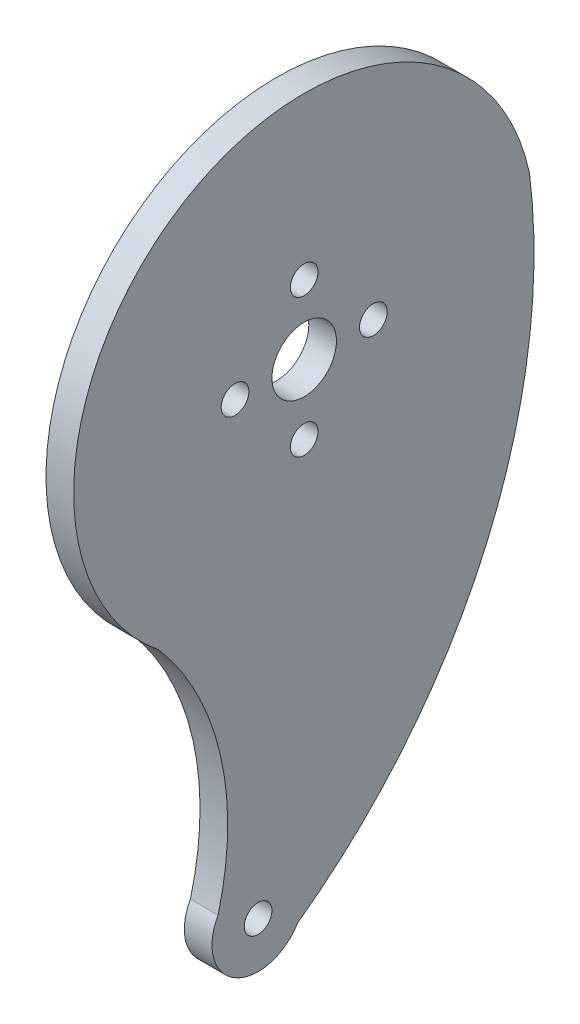
ISO-10303-21;
HEADER;
FILE_DESCRIPTION(('STEP AP214'),'2;1');
FILE_NAME('part.step','',(''),(''),'','','');
FILE_SCHEMA(('AUTOMOTIVE_DESIGN { 1 0 10303 214 1 1 1 1 }'));
ENDSEC;
DATA;
#1=APPLICATION_CONTEXT('core data for automotive mechanical design processes');
#2=APPLICATION_PROTOCOL_DEFINITION('international standard','automotive_design',2000,#1);
#3=PRODUCT_CONTEXT('',#1,'mechanical');
#4=PRODUCT('Part','Part','',(#3));
#5=PRODUCT_RELATED_PRODUCT_CATEGORY('part','',(#4));
#6=PRODUCT_DEFINITION_FORMATION('','',#4);
#7=PRODUCT_DEFINITION_CONTEXT('part definition',#1,'design');
#8=PRODUCT_DEFINITION('design','',#6,#7);
#9=PRODUCT_DEFINITION_SHAPE('','',#8);
#10=(LENGTH_UNIT() NAMED_UNIT(*) SI_UNIT(.MILLI.,.METRE.));
#11=(NAMED_UNIT(*) PLANE_ANGLE_UNIT() SI_UNIT($,.RADIAN.));
#12=(NAMED_UNIT(*) SI_UNIT($,.STERADIAN.) SOLID_ANGLE_UNIT());
#13=UNCERTAINTY_MEASURE_WITH_UNIT(LENGTH_MEASURE(1.E-05),#10,'distance_accuracy_value','');
#14=(GEOMETRIC_REPRESENTATION_CONTEXT(3) GLOBAL_UNCERTAINTY_ASSIGNED_CONTEXT((#13)) GLOBAL_UNIT_ASSIGNED_CONTEXT((#10,
#11,#12)) REPRESENTATION_CONTEXT('',''));
#15=CARTESIAN_POINT('',(0.,0.,0.));
#16=DIRECTION('',(0.,0.,1.));
#17=DIRECTION('',(1.,0.,0.));
#18=AXIS2_PLACEMENT_3D('',#15,#16,#17);
#19=CARTESIAN_POINT('',(3.,-19.7769228284302,19.6157243721853));
#20=DIRECTION('',(1.,0.,0.));
#21=DIRECTION('',(0.,0.,-1.));
#22=AXIS2_PLACEMENT_3D('',#19,#20,#21);
#23=PLANE('',#22);
#24=CARTESIAN_POINT('',(3.,0.,-7.5));
#25=DIRECTION('',(1.,0.,0.));
#26=DIRECTION('',(0.,0.,-1.));
#27=AXIS2_PLACEMENT_3D('',#24,#25,#26);
#28=CIRCLE('',#27,1.5);
#29=CARTESIAN_POINT('',(3.,0.,-9.));
#30=VERTEX_POINT('',#29);
#31=EDGE_CURVE('E132',#30,#30,#28,.T.);
#32=ORIENTED_EDGE('',*,*,#31,.F.);
#33=EDGE_LOOP('',(#32));
#34=FACE_BOUND('',#33,.T.);
#35=CARTESIAN_POINT('',(3.,0.,7.5));
#36=DIRECTION('',(1.,0.,0.));
#37=DIRECTION('',(0.,0.,-1.));
#38=AXIS2_PLACEMENT_3D('',#35,#36,#37);
#39=CIRCLE('',#38,1.5);
#40=CARTESIAN_POINT('',(3.,0.,6.));
#41=VERTEX_POINT('',#40);
#42=EDGE_CURVE('E120',#41,#41,#39,.T.);
#43=ORIENTED_EDGE('',*,*,#42,.F.);
#44=EDGE_LOOP('',(#43));
#45=FACE_BOUND('',#44,.T.);
#46=CARTESIAN_POINT('',(3.,0.,0.));
#47=DIRECTION('',(1.,0.,0.));
#48=DIRECTION('',(0.,0.,-1.));
#49=AXIS2_PLACEMENT_3D('',#46,#47,#48);
#50=CIRCLE('',#49,3.5);
#51=CARTESIAN_POINT('',(3.,0.,-3.5));
#52=VERTEX_POINT('',#51);
#53=EDGE_CURVE('E99',#52,#52,#50,.T.);
#54=ORIENTED_EDGE('',*,*,#53,.F.);
#55=EDGE_LOOP('',(#54));
#56=FACE_BOUND('',#55,.T.);
#57=CARTESIAN_POINT('',(3.,-39.5538456568604,39.2314487443705));
#58=DIRECTION('',(-1.,0.,0.));
#59=DIRECTION('',(0.,0.,-1.));
#60=AXIS2_PLACEMENT_3D('',#57,#58,#59);
#61=CIRCLE('',#60,30.9348802246162);
#62=CARTESIAN_POINT('',(3.,-19.415467183855,15.7492740795457));
#63=VERTEX_POINT('',#62);
#64=CARTESIAN_POINT('',(3.,-47.5142601565081,9.33832887532466));
#65=VERTEX_POINT('',#64);
#66=EDGE_CURVE('E84',#63,#65,#61,.T.);
#67=ORIENTED_EDGE('',*,*,#66,.T.);
#68=CARTESIAN_POINT('',(3.,-50.,4.99999999999987));
#69=DIRECTION('',(1.,0.,0.));
#70=DIRECTION('',(0.,0.,-1.));
#71=AXIS2_PLACEMENT_3D('',#68,#69,#70);
#72=CIRCLE('',#71,5.);
#73=CARTESIAN_POINT('',(3.,-52.5694897812166,0.710743390256941));
#74=VERTEX_POINT('',#73);
#75=EDGE_CURVE('E79',#65,#74,#72,.T.);
#76=ORIENTED_EDGE('',*,*,#75,.T.);
#77=CARTESIAN_POINT('',(3.,-2.49541602183387,36.7973853175287));
#78=DIRECTION('',(1.,0.,0.));
#79=DIRECTION('',(0.,0.,1.));
#80=AXIS2_PLACEMENT_3D('',#77,#78,#79);
#81=CIRCLE('',#80,61.7224318092477);
#82=CARTESIAN_POINT('',(3.,5.31054625443354,-24.4294514567872));
#83=VERTEX_POINT('',#82);
#84=EDGE_CURVE('E82',#74,#83,#81,.T.);
#85=ORIENTED_EDGE('',*,*,#84,.T.);
#86=CARTESIAN_POINT('',(3.,0.,0.));
#87=DIRECTION('',(1.,0.,0.));
#88=DIRECTION('',(0.,0.,-1.));
#89=AXIS2_PLACEMENT_3D('',#86,#87,#88);
#90=CIRCLE('',#89,25.);
#91=EDGE_CURVE('E49',#83,#63,#90,.T.);
#92=ORIENTED_EDGE('',*,*,#91,.T.);
#93=EDGE_LOOP('',(#67,#76,#85,#92));
#94=FACE_BOUND('',#93,.T.);
#95=CARTESIAN_POINT('',(3.,-50.,4.99999999999987));
#96=DIRECTION('',(1.,0.,0.));
#97=DIRECTION('',(0.,0.,-1.));
#98=AXIS2_PLACEMENT_3D('',#95,#96,#97);
#99=CIRCLE('',#98,1.5);
#100=CARTESIAN_POINT('',(3.,-50.,3.49999999999987));
#101=VERTEX_POINT('',#100);
#102=EDGE_CURVE('E114',#101,#101,#99,.T.);
#103=ORIENTED_EDGE('',*,*,#102,.F.);
#104=EDGE_LOOP('',(#103));
#105=FACE_BOUND('',#104,.T.);
#106=CARTESIAN_POINT('',(3.,7.5,0.));
#107=DIRECTION('',(1.,0.,0.));
#108=DIRECTION('',(0.,0.,-1.));
#109=AXIS2_PLACEMENT_3D('',#106,#107,#108);
#110=CIRCLE('',#109,1.5);
#111=CARTESIAN_POINT('',(3.,7.5,-1.5));
#112=VERTEX_POINT('',#111);
#113=EDGE_CURVE('E126',#112,#112,#110,.T.);
#114=ORIENTED_EDGE('',*,*,#113,.F.);
#115=EDGE_LOOP('',(#114));
#116=FACE_BOUND('',#115,.T.);
#117=CARTESIAN_POINT('',(3.,-7.5,0.));
#118=DIRECTION('',(1.,0.,0.));
#119=DIRECTION('',(0.,0.,-1.));
#120=AXIS2_PLACEMENT_3D('',#117,#118,#119);
#121=CIRCLE('',#120,1.5);
#122=CARTESIAN_POINT('',(3.,-7.5,-1.5));
#123=VERTEX_POINT('',#122);
#124=EDGE_CURVE('E138',#123,#123,#121,.T.);
#125=ORIENTED_EDGE('',*,*,#124,.F.);
#126=EDGE_LOOP('',(#125));
#127=FACE_BOUND('',#126,.T.);
#128=ADVANCED_FACE('F32',(#34,#45,#56,#94,#105,#116,#127),#23,.T.);
#129=CARTESIAN_POINT('',(0.,-19.7769228284302,19.6157243721853));
#130=DIRECTION('',(1.,0.,0.));
#131=DIRECTION('',(0.,0.,-1.));
#132=AXIS2_PLACEMENT_3D('',#129,#130,#131);
#133=PLANE('',#132);
#134=CARTESIAN_POINT('',(0.,0.,-7.5));
#135=DIRECTION('',(1.,0.,0.));
#136=DIRECTION('',(0.,0.,-1.));
#137=AXIS2_PLACEMENT_3D('',#134,#135,#136);
#138=CIRCLE('',#137,1.5);
#139=CARTESIAN_POINT('',(0.,0.,-9.));
#140=VERTEX_POINT('',#139);
#141=EDGE_CURVE('E135',#140,#140,#138,.T.);
#142=ORIENTED_EDGE('',*,*,#141,.T.);
#143=EDGE_LOOP('',(#142));
#144=FACE_BOUND('',#143,.T.);
#145=CARTESIAN_POINT('',(0.,0.,7.5));
#146=DIRECTION('',(1.,0.,0.));
#147=DIRECTION('',(0.,0.,-1.));
#148=AXIS2_PLACEMENT_3D('',#145,#146,#147);
#149=CIRCLE('',#148,1.5);
#150=CARTESIAN_POINT('',(0.,0.,6.));
#151=VERTEX_POINT('',#150);
#152=EDGE_CURVE('E123',#151,#151,#149,.T.);
#153=ORIENTED_EDGE('',*,*,#152,.T.);
#154=EDGE_LOOP('',(#153));
#155=FACE_BOUND('',#154,.T.);
#156=CARTESIAN_POINT('',(0.,0.,0.));
#157=DIRECTION('',(1.,0.,0.));
#158=DIRECTION('',(0.,0.,-1.));
#159=AXIS2_PLACEMENT_3D('',#156,#157,#158);
#160=CIRCLE('',#159,3.5);
#161=CARTESIAN_POINT('',(0.,0.,-3.5));
#162=VERTEX_POINT('',#161);
#163=EDGE_CURVE('E111',#162,#162,#160,.T.);
#164=ORIENTED_EDGE('',*,*,#163,.T.);
#165=EDGE_LOOP('',(#164));
#166=FACE_BOUND('',#165,.T.);
#167=CARTESIAN_POINT('',(0.,-39.5538456568604,39.2314487443705));
#168=DIRECTION('',(-1.,0.,0.));
#169=DIRECTION('',(0.,0.,-1.));
#170=AXIS2_PLACEMENT_3D('',#167,#168,#169);
#171=CIRCLE('',#170,30.9348802246162);
#172=CARTESIAN_POINT('',(0.,-19.415467183855,15.7492740795457));
#173=VERTEX_POINT('',#172);
#174=CARTESIAN_POINT('',(0.,-47.5142601565081,9.33832887532466));
#175=VERTEX_POINT('',#174);
#176=EDGE_CURVE('E96',#173,#175,#171,.T.);
#177=ORIENTED_EDGE('',*,*,#176,.F.);
#178=CARTESIAN_POINT('',(0.,0.,0.));
#179=DIRECTION('',(1.,0.,0.));
#180=DIRECTION('',(0.,0.,-1.));
#181=AXIS2_PLACEMENT_3D('',#178,#179,#180);
#182=CIRCLE('',#181,25.);
#183=CARTESIAN_POINT('',(0.,5.31054625443354,-24.4294514567872));
#184=VERTEX_POINT('',#183);
#185=EDGE_CURVE('E72',#184,#173,#182,.T.);
#186=ORIENTED_EDGE('',*,*,#185,.F.);
#187=CARTESIAN_POINT('',(0.,-2.49541602183387,36.7973853175287));
#188=DIRECTION('',(1.,0.,0.));
#189=DIRECTION('',(0.,0.,1.));
#190=AXIS2_PLACEMENT_3D('',#187,#188,#189);
#191=CIRCLE('',#190,61.7224318092477);
#192=CARTESIAN_POINT('',(0.,-52.5694897812166,0.710743390256941));
#193=VERTEX_POINT('',#192);
#194=EDGE_CURVE('E66',#193,#184,#191,.T.);
#195=ORIENTED_EDGE('',*,*,#194,.F.);
#196=CARTESIAN_POINT('',(0.,-50.,4.99999999999987));
#197=DIRECTION('',(1.,0.,0.));
#198=DIRECTION('',(0.,0.,-1.));
#199=AXIS2_PLACEMENT_3D('',#196,#197,#198);
#200=CIRCLE('',#199,5.);
#201=EDGE_CURVE('E88',#175,#193,#200,.T.);
#202=ORIENTED_EDGE('',*,*,#201,.F.);
#203=EDGE_LOOP('',(#177,#186,#195,#202));
#204=FACE_BOUND('',#203,.T.);
#205=CARTESIAN_POINT('',(0.,-50.,4.99999999999987));
#206=DIRECTION('',(1.,0.,0.));
#207=DIRECTION('',(0.,0.,-1.));
#208=AXIS2_PLACEMENT_3D('',#205,#206,#207);
#209=CIRCLE('',#208,1.5);
#210=CARTESIAN_POINT('',(0.,-50.,3.49999999999987));
#211=VERTEX_POINT('',#210);
#212=EDGE_CURVE('E117',#211,#211,#209,.T.);
#213=ORIENTED_EDGE('',*,*,#212,.T.);
#214=EDGE_LOOP('',(#213));
#215=FACE_BOUND('',#214,.T.);
#216=CARTESIAN_POINT('',(0.,7.5,0.));
#217=DIRECTION('',(1.,0.,0.));
#218=DIRECTION('',(0.,0.,-1.));
#219=AXIS2_PLACEMENT_3D('',#216,#217,#218);
#220=CIRCLE('',#219,1.5);
#221=CARTESIAN_POINT('',(0.,7.5,-1.5));
#222=VERTEX_POINT('',#221);
#223=EDGE_CURVE('E129',#222,#222,#220,.T.);
#224=ORIENTED_EDGE('',*,*,#223,.T.);
#225=EDGE_LOOP('',(#224));
#226=FACE_BOUND('',#225,.T.);
#227=CARTESIAN_POINT('',(0.,-7.5,0.));
#228=DIRECTION('',(1.,0.,0.));
#229=DIRECTION('',(0.,0.,-1.));
#230=AXIS2_PLACEMENT_3D('',#227,#228,#229);
#231=CIRCLE('',#230,1.5);
#232=CARTESIAN_POINT('',(0.,-7.5,-1.5));
#233=VERTEX_POINT('',#232);
#234=EDGE_CURVE('E141',#233,#233,#231,.T.);
#235=ORIENTED_EDGE('',*,*,#234,.T.);
#236=EDGE_LOOP('',(#235));
#237=FACE_BOUND('',#236,.T.);
#238=ADVANCED_FACE('F107',(#144,#155,#166,#204,#215,#226,#237),#133,.F.);
#239=CARTESIAN_POINT('',(3.,-39.5538456568604,39.2314487443705));
#240=DIRECTION('',(-1.,0.,0.));
#241=DIRECTION('',(0.,0.,1.));
#242=AXIS2_PLACEMENT_3D('',#239,#240,#241);
#243=CYLINDRICAL_SURFACE('',#242,30.9348802246162);
#244=ORIENTED_EDGE('',*,*,#176,.T.);
#245=DIRECTION('',(-1.,0.,0.));
#246=VECTOR('',#245,1.);
#247=CARTESIAN_POINT('',(3.,-47.5142601565081,9.33832887532466));
#248=LINE('',#247,#246);
#249=EDGE_CURVE('E11',#65,#175,#248,.T.);
#250=ORIENTED_EDGE('',*,*,#249,.F.);
#251=ORIENTED_EDGE('',*,*,#66,.F.);
#252=DIRECTION('',(-1.,0.,0.));
#253=VECTOR('',#252,1.);
#254=CARTESIAN_POINT('',(3.,-19.415467183855,15.7492740795457));
#255=LINE('',#254,#253);
#256=EDGE_CURVE('E92',#63,#173,#255,.T.);
#257=ORIENTED_EDGE('',*,*,#256,.T.);
#258=EDGE_LOOP('',(#244,#250,#251,#257));
#259=FACE_BOUND('',#258,.T.);
#260=ADVANCED_FACE('F34',(#259),#243,.F.);
#261=CARTESIAN_POINT('',(3.,-50.,4.99999999999987));
#262=DIRECTION('',(-1.,0.,0.));
#263=DIRECTION('',(0.,0.,1.));
#264=AXIS2_PLACEMENT_3D('',#261,#262,#263);
#265=CYLINDRICAL_SURFACE('',#264,5.);
#266=ORIENTED_EDGE('',*,*,#201,.T.);
#267=DIRECTION('',(-1.,0.,0.));
#268=VECTOR('',#267,1.);
#269=CARTESIAN_POINT('',(3.,-52.5694897812166,0.710743390256941));
#270=LINE('',#269,#268);
#271=EDGE_CURVE('E41',#74,#193,#270,.T.);
#272=ORIENTED_EDGE('',*,*,#271,.F.);
#273=ORIENTED_EDGE('',*,*,#75,.F.);
#274=ORIENTED_EDGE('',*,*,#249,.T.);
#275=EDGE_LOOP('',(#266,#272,#273,#274));
#276=FACE_BOUND('',#275,.T.);
#277=ADVANCED_FACE('F87',(#276),#265,.T.);
#278=CARTESIAN_POINT('',(3.,-2.49541602183387,36.7973853175287));
#279=DIRECTION('',(-1.,0.,0.));
#280=DIRECTION('',(0.,0.,1.));
#281=AXIS2_PLACEMENT_3D('',#278,#279,#280);
#282=CYLINDRICAL_SURFACE('',#281,61.7224318092477);
#283=ORIENTED_EDGE('',*,*,#194,.T.);
#284=DIRECTION('',(-1.,0.,0.));
#285=VECTOR('',#284,1.);
#286=CARTESIAN_POINT('',(3.,5.31054625443354,-24.4294514567872));
#287=LINE('',#286,#285);
#288=EDGE_CURVE('E89',#83,#184,#287,.T.);
#289=ORIENTED_EDGE('',*,*,#288,.F.);
#290=ORIENTED_EDGE('',*,*,#84,.F.);
#291=ORIENTED_EDGE('',*,*,#271,.T.);
#292=EDGE_LOOP('',(#283,#289,#290,#291));
#293=FACE_BOUND('',#292,.T.);
#294=ADVANCED_FACE('F90',(#293),#282,.T.);
#295=CARTESIAN_POINT('',(3.,0.,0.));
#296=DIRECTION('',(-1.,0.,0.));
#297=DIRECTION('',(0.,0.,1.));
#298=AXIS2_PLACEMENT_3D('',#295,#296,#297);
#299=CYLINDRICAL_SURFACE('',#298,25.);
#300=ORIENTED_EDGE('',*,*,#185,.T.);
#301=ORIENTED_EDGE('',*,*,#256,.F.);
#302=ORIENTED_EDGE('',*,*,#91,.F.);
#303=ORIENTED_EDGE('',*,*,#288,.T.);
#304=EDGE_LOOP('',(#300,#301,#302,#303));
#305=FACE_BOUND('',#304,.T.);
#306=ADVANCED_FACE('F104',(#305),#299,.T.);
#307=CARTESIAN_POINT('',(3.,0.,0.));
#308=DIRECTION('',(-1.,0.,0.));
#309=DIRECTION('',(0.,0.,1.));
#310=AXIS2_PLACEMENT_3D('',#307,#308,#309);
#311=CYLINDRICAL_SURFACE('',#310,3.5);
#312=ORIENTED_EDGE('',*,*,#53,.T.);
#313=EDGE_LOOP('',(#312));
#314=FACE_BOUND('',#313,.T.);
#315=ORIENTED_EDGE('',*,*,#163,.F.);
#316=EDGE_LOOP('',(#315));
#317=FACE_BOUND('',#316,.T.);
#318=ADVANCED_FACE('F161',(#314,#317),#311,.F.);
#319=CARTESIAN_POINT('',(3.,-50.,4.99999999999987));
#320=DIRECTION('',(-1.,0.,0.));
#321=DIRECTION('',(0.,0.,1.));
#322=AXIS2_PLACEMENT_3D('',#319,#320,#321);
#323=CYLINDRICAL_SURFACE('',#322,1.5);
#324=ORIENTED_EDGE('',*,*,#102,.T.);
#325=EDGE_LOOP('',(#324));
#326=FACE_BOUND('',#325,.T.);
#327=ORIENTED_EDGE('',*,*,#212,.F.);
#328=EDGE_LOOP('',(#327));
#329=FACE_BOUND('',#328,.T.);
#330=ADVANCED_FACE('F207',(#326,#329),#323,.F.);
#331=CARTESIAN_POINT('',(3.,0.,7.5));
#332=DIRECTION('',(-1.,0.,0.));
#333=DIRECTION('',(0.,0.,1.));
#334=AXIS2_PLACEMENT_3D('',#331,#332,#333);
#335=CYLINDRICAL_SURFACE('',#334,1.5);
#336=ORIENTED_EDGE('',*,*,#42,.T.);
#337=EDGE_LOOP('',(#336));
#338=FACE_BOUND('',#337,.T.);
#339=ORIENTED_EDGE('',*,*,#152,.F.);
#340=EDGE_LOOP('',(#339));
#341=FACE_BOUND('',#340,.T.);
#342=ADVANCED_FACE('F215',(#338,#341),#335,.F.);
#343=CARTESIAN_POINT('',(3.,7.5,0.));
#344=DIRECTION('',(-1.,0.,0.));
#345=DIRECTION('',(0.,0.,1.));
#346=AXIS2_PLACEMENT_3D('',#343,#344,#345);
#347=CYLINDRICAL_SURFACE('',#346,1.5);
#348=ORIENTED_EDGE('',*,*,#113,.T.);
#349=EDGE_LOOP('',(#348));
#350=FACE_BOUND('',#349,.T.);
#351=ORIENTED_EDGE('',*,*,#223,.F.);
#352=EDGE_LOOP('',(#351));
#353=FACE_BOUND('',#352,.T.);
#354=ADVANCED_FACE('F223',(#350,#353),#347,.F.);
#355=CARTESIAN_POINT('',(3.,0.,-7.5));
#356=DIRECTION('',(-1.,0.,0.));
#357=DIRECTION('',(0.,0.,1.));
#358=AXIS2_PLACEMENT_3D('',#355,#356,#357);
#359=CYLINDRICAL_SURFACE('',#358,1.5);
#360=ORIENTED_EDGE('',*,*,#31,.T.);
#361=EDGE_LOOP('',(#360));
#362=FACE_BOUND('',#361,.T.);
#363=ORIENTED_EDGE('',*,*,#141,.F.);
#364=EDGE_LOOP('',(#363));
#365=FACE_BOUND('',#364,.T.);
#366=ADVANCED_FACE('F232',(#362,#365),#359,.F.);
#367=CARTESIAN_POINT('',(3.,-7.5,0.));
#368=DIRECTION('',(-1.,0.,0.));
#369=DIRECTION('',(0.,0.,1.));
#370=AXIS2_PLACEMENT_3D('',#367,#368,#369);
#371=CYLINDRICAL_SURFACE('',#370,1.5);
#372=ORIENTED_EDGE('',*,*,#124,.T.);
#373=EDGE_LOOP('',(#372));
#374=FACE_BOUND('',#373,.T.);
#375=ORIENTED_EDGE('',*,*,#234,.F.);
#376=EDGE_LOOP('',(#375));
#377=FACE_BOUND('',#376,.T.);
#378=ADVANCED_FACE('F147',(#374,#377),#371,.F.);
#379=CLOSED_SHELL('',(#128,#238,#260,#277,#294,#306,#318,#330,#342,#354,#366,#378));
#380=MANIFOLD_SOLID_BREP('B2',#379);
#381=ADVANCED_BREP_SHAPE_REPRESENTATION('',(#18,#380),#14);
#382=SHAPE_DEFINITION_REPRESENTATION(#9,#381);
ENDSEC;
END-ISO-10303-21;
